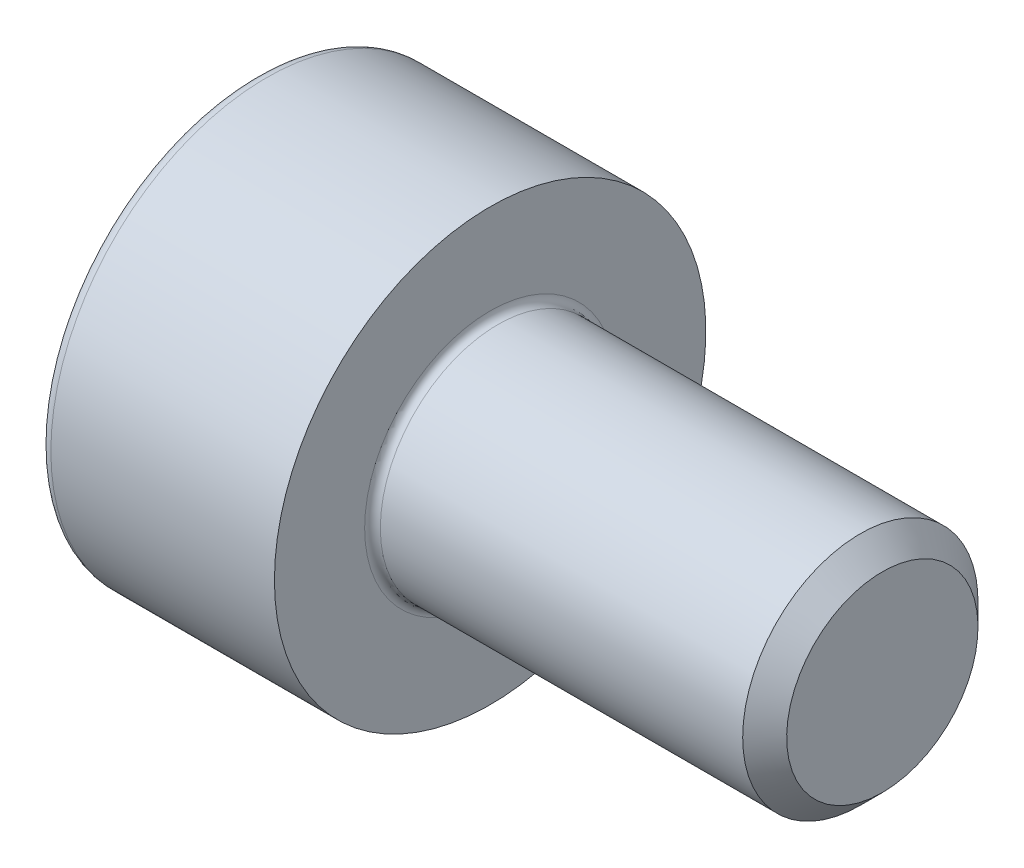
ISO-10303-21;
HEADER;
FILE_DESCRIPTION(('STEP AP214'),'2;1');
FILE_NAME('part.step','',(''),(''),'','','');
FILE_SCHEMA(('AUTOMOTIVE_DESIGN { 1 0 10303 214 1 1 1 1 }'));
ENDSEC;
DATA;
#1=APPLICATION_CONTEXT('core data for automotive mechanical design processes');
#2=APPLICATION_PROTOCOL_DEFINITION('international standard','automotive_design',2000,#1);
#3=PRODUCT_CONTEXT('',#1,'mechanical');
#4=PRODUCT('Part','Part','',(#3));
#5=PRODUCT_RELATED_PRODUCT_CATEGORY('part','',(#4));
#6=PRODUCT_DEFINITION_FORMATION('','',#4);
#7=PRODUCT_DEFINITION_CONTEXT('part definition',#1,'design');
#8=PRODUCT_DEFINITION('design','',#6,#7);
#9=PRODUCT_DEFINITION_SHAPE('','',#8);
#10=(LENGTH_UNIT() NAMED_UNIT(*) SI_UNIT(.MILLI.,.METRE.));
#11=(NAMED_UNIT(*) PLANE_ANGLE_UNIT() SI_UNIT($,.RADIAN.));
#12=(NAMED_UNIT(*) SI_UNIT($,.STERADIAN.) SOLID_ANGLE_UNIT());
#13=UNCERTAINTY_MEASURE_WITH_UNIT(LENGTH_MEASURE(1.E-05),#10,'distance_accuracy_value','');
#14=(GEOMETRIC_REPRESENTATION_CONTEXT(3) GLOBAL_UNCERTAINTY_ASSIGNED_CONTEXT((#13)) GLOBAL_UNIT_ASSIGNED_CONTEXT((#10,
#11,#12)) REPRESENTATION_CONTEXT('',''));
#15=CARTESIAN_POINT('',(0.,0.,0.));
#16=DIRECTION('',(0.,0.,1.));
#17=DIRECTION('',(1.,0.,0.));
#18=AXIS2_PLACEMENT_3D('',#15,#16,#17);
#19=CARTESIAN_POINT('',(8.,1.2195,0.));
#20=DIRECTION('',(1.,0.,0.));
#21=DIRECTION('',(0.,0.,-1.));
#22=AXIS2_PLACEMENT_3D('',#19,#20,#21);
#23=PLANE('',#22);
#24=CARTESIAN_POINT('',(7.99999999992451,0.,0.));
#25=DIRECTION('',(-1.,0.,0.));
#26=DIRECTION('',(0.,-1.,0.));
#27=AXIS2_PLACEMENT_3D('',#24,#25,#26);
#28=CIRCLE('',#27,1.2194999999906);
#29=CARTESIAN_POINT('',(7.99999999992451,-1.2194999999906,0.));
#30=VERTEX_POINT('',#29);
#31=EDGE_CURVE('E107',#30,#30,#28,.T.);
#32=ORIENTED_EDGE('',*,*,#31,.F.);
#33=EDGE_LOOP('',(#32));
#34=FACE_BOUND('',#33,.T.);
#35=ADVANCED_FACE('F16',(#34),#23,.T.);
#36=CARTESIAN_POINT('',(1.30000000012842,0.,0.));
#37=DIRECTION('',(-1.,0.,0.));
#38=DIRECTION('',(0.,0.,1.));
#39=AXIS2_PLACEMENT_3D('',#36,#37,#38);
#40=CONICAL_SURFACE('',#39,1.27999999978101,1.04719755091874);
#41=CARTESIAN_POINT('',(2.0390083446955,0.,2.8421709430404E-10));
#42=VERTEX_POINT('',#41);
#43=VERTEX_LOOP('',#42);
#44=FACE_BOUND('',#43,.T.);
#45=CARTESIAN_POINT('',(1.29999999999715,0.,0.));
#46=DIRECTION('',(-1.,0.,0.));
#47=DIRECTION('',(0.,0.,1.));
#48=AXIS2_PLACEMENT_3D('',#45,#46,#47);
#49=CIRCLE('',#48,1.28000000000839);
#50=CARTESIAN_POINT('',(1.29999999999857,-1.10851251684771,0.640000000002098));
#51=VERTEX_POINT('',#50);
#52=CARTESIAN_POINT('',(1.30000000000226,0.,1.28000000000209));
#53=VERTEX_POINT('',#52);
#54=EDGE_CURVE('E96',#51,#53,#49,.T.);
#55=ORIENTED_EDGE('',*,*,#54,.T.);
#56=CARTESIAN_POINT('',(1.29999999999715,0.,0.));
#57=DIRECTION('',(-1.,0.,0.));
#58=DIRECTION('',(0.,0.,1.));
#59=AXIS2_PLACEMENT_3D('',#56,#57,#58);
#60=CIRCLE('',#59,1.28000000000839);
#61=CARTESIAN_POINT('',(1.29999999999857,1.10851251684771,0.640000000002095));
#62=VERTEX_POINT('',#61);
#63=EDGE_CURVE('E99',#53,#62,#60,.T.);
#64=ORIENTED_EDGE('',*,*,#63,.T.);
#65=CARTESIAN_POINT('',(1.29999999999715,0.,0.));
#66=DIRECTION('',(-1.,0.,0.));
#67=DIRECTION('',(0.,0.,1.));
#68=AXIS2_PLACEMENT_3D('',#65,#66,#67);
#69=CIRCLE('',#68,1.28000000000839);
#70=CARTESIAN_POINT('',(1.29999999999857,1.10851251684771,-0.640000000002099));
#71=VERTEX_POINT('',#70);
#72=EDGE_CURVE('E102',#62,#71,#69,.T.);
#73=ORIENTED_EDGE('',*,*,#72,.T.);
#74=CARTESIAN_POINT('',(1.29999999999715,0.,0.));
#75=DIRECTION('',(-1.,0.,0.));
#76=DIRECTION('',(0.,0.,1.));
#77=AXIS2_PLACEMENT_3D('',#74,#75,#76);
#78=CIRCLE('',#77,1.28000000000839);
#79=CARTESIAN_POINT('',(1.30000000000226,0.,-1.28000000000629));
#80=VERTEX_POINT('',#79);
#81=EDGE_CURVE('E117',#71,#80,#78,.T.);
#82=ORIENTED_EDGE('',*,*,#81,.T.);
#83=CARTESIAN_POINT('',(1.29999999999715,0.,0.));
#84=DIRECTION('',(-1.,0.,0.));
#85=DIRECTION('',(0.,0.,1.));
#86=AXIS2_PLACEMENT_3D('',#83,#84,#85);
#87=CIRCLE('',#86,1.28000000000839);
#88=CARTESIAN_POINT('',(1.29999999999857,-1.10851251684771,-0.640000000002097));
#89=VERTEX_POINT('',#88);
#90=EDGE_CURVE('E118',#80,#89,#87,.T.);
#91=ORIENTED_EDGE('',*,*,#90,.T.);
#92=CARTESIAN_POINT('',(1.29999999999715,0.,0.));
#93=DIRECTION('',(-1.,0.,0.));
#94=DIRECTION('',(0.,0.,1.));
#95=AXIS2_PLACEMENT_3D('',#92,#93,#94);
#96=CIRCLE('',#95,1.28000000000839);
#97=EDGE_CURVE('E225',#89,#51,#96,.T.);
#98=ORIENTED_EDGE('',*,*,#97,.T.);
#99=EDGE_LOOP('',(#55,#64,#73,#82,#91,#98));
#100=FACE_BOUND('',#99,.T.);
#101=ADVANCED_FACE('F101',(#44,#100),#40,.F.);
#102=CARTESIAN_POINT('',(7.71950000000743,0.,0.));
#103=DIRECTION('',(-1.,0.,0.));
#104=DIRECTION('',(0.,-1.,0.));
#105=AXIS2_PLACEMENT_3D('',#102,#103,#104);
#106=CONICAL_SURFACE('',#105,1.49999999996453,0.785398163498773);
#107=CARTESIAN_POINT('',(7.71949999999995,0.,0.));
#108=DIRECTION('',(-1.,0.,0.));
#109=DIRECTION('',(0.,0.,1.));
#110=AXIS2_PLACEMENT_3D('',#107,#108,#109);
#111=CIRCLE('',#110,1.49999999999997);
#112=CARTESIAN_POINT('',(7.71949999999995,0.,1.49999999999997));
#113=VERTEX_POINT('',#112);
#114=EDGE_CURVE('E132',#113,#113,#111,.T.);
#115=ORIENTED_EDGE('',*,*,#114,.F.);
#116=EDGE_LOOP('',(#115));
#117=FACE_BOUND('',#116,.T.);
#118=ORIENTED_EDGE('',*,*,#31,.T.);
#119=EDGE_LOOP('',(#118));
#120=FACE_BOUND('',#119,.T.);
#121=ADVANCED_FACE('F518',(#117,#120),#106,.T.);
#122=CARTESIAN_POINT('',(1.3,1.47801668912544,0.));
#123=DIRECTION('',(1.,0.,0.));
#124=DIRECTION('',(0.,0.,-1.));
#125=AXIS2_PLACEMENT_3D('',#122,#123,#124);
#126=PLANE('',#125);
#127=DIRECTION('',(0.,0.499999999999999,-0.866025403784439));
#128=VECTOR('',#127,1.);
#129=CARTESIAN_POINT('',(1.3,1.47801668912544,0.));
#130=LINE('',#129,#128);
#131=CARTESIAN_POINT('',(1.3,0.73900834456272,1.28));
#132=VERTEX_POINT('',#131);
#133=EDGE_CURVE('E121',#62,#132,#130,.F.);
#134=ORIENTED_EDGE('',*,*,#133,.F.);
#135=ORIENTED_EDGE('',*,*,#63,.F.);
#136=DIRECTION('',(0.,-1.,0.));
#137=VECTOR('',#136,1.);
#138=CARTESIAN_POINT('',(1.3,-0.739008344562723,1.28));
#139=LINE('',#138,#137);
#140=EDGE_CURVE('E123',#53,#132,#139,.F.);
#141=ORIENTED_EDGE('',*,*,#140,.T.);
#142=EDGE_LOOP('',(#134,#135,#141));
#143=FACE_BOUND('',#142,.T.);
#144=ADVANCED_FACE('F122',(#143),#126,.F.);
#145=CARTESIAN_POINT('',(1.3,1.47801668912544,0.));
#146=DIRECTION('',(1.,0.,0.));
#147=DIRECTION('',(0.,0.,-1.));
#148=AXIS2_PLACEMENT_3D('',#145,#146,#147);
#149=PLANE('',#148);
#150=DIRECTION('',(0.,-1.,0.));
#151=VECTOR('',#150,1.);
#152=CARTESIAN_POINT('',(1.3,-0.739008344562723,1.28));
#153=LINE('',#152,#151);
#154=CARTESIAN_POINT('',(1.3,-0.739008344562723,1.28));
#155=VERTEX_POINT('',#154);
#156=EDGE_CURVE('E127',#155,#53,#153,.F.);
#157=ORIENTED_EDGE('',*,*,#156,.T.);
#158=ORIENTED_EDGE('',*,*,#54,.F.);
#159=DIRECTION('',(0.,0.500000000000001,0.866025403784438));
#160=VECTOR('',#159,1.);
#161=CARTESIAN_POINT('',(1.3,-0.739008344562723,1.28));
#162=LINE('',#161,#160);
#163=EDGE_CURVE('E182',#155,#51,#162,.F.);
#164=ORIENTED_EDGE('',*,*,#163,.F.);
#165=EDGE_LOOP('',(#157,#158,#164));
#166=FACE_BOUND('',#165,.T.);
#167=ADVANCED_FACE('F371',(#166),#149,.F.);
#168=CARTESIAN_POINT('',(1.3,1.47801668912544,0.));
#169=DIRECTION('',(1.,0.,0.));
#170=DIRECTION('',(0.,0.,-1.));
#171=AXIS2_PLACEMENT_3D('',#168,#169,#170);
#172=PLANE('',#171);
#173=DIRECTION('',(0.,0.500000000000001,0.866025403784438));
#174=VECTOR('',#173,1.);
#175=CARTESIAN_POINT('',(1.3,-0.739008344562723,1.28));
#176=LINE('',#175,#174);
#177=CARTESIAN_POINT('',(1.3,-1.47801668912545,0.));
#178=VERTEX_POINT('',#177);
#179=EDGE_CURVE('E178',#51,#178,#176,.F.);
#180=ORIENTED_EDGE('',*,*,#179,.F.);
#181=ORIENTED_EDGE('',*,*,#97,.F.);
#182=DIRECTION('',(0.,-0.499999999999999,0.866025403784439));
#183=VECTOR('',#182,1.);
#184=CARTESIAN_POINT('',(1.3,-1.47801668912545,0.));
#185=LINE('',#184,#183);
#186=EDGE_CURVE('E164',#178,#89,#185,.F.);
#187=ORIENTED_EDGE('',*,*,#186,.F.);
#188=EDGE_LOOP('',(#180,#181,#187));
#189=FACE_BOUND('',#188,.T.);
#190=ADVANCED_FACE('F366',(#189),#172,.F.);
#191=CARTESIAN_POINT('',(1.3,1.47801668912544,0.));
#192=DIRECTION('',(1.,0.,0.));
#193=DIRECTION('',(0.,0.,-1.));
#194=AXIS2_PLACEMENT_3D('',#191,#192,#193);
#195=PLANE('',#194);
#196=DIRECTION('',(0.,-0.499999999999999,0.866025403784439));
#197=VECTOR('',#196,1.);
#198=CARTESIAN_POINT('',(1.3,-1.47801668912545,0.));
#199=LINE('',#198,#197);
#200=CARTESIAN_POINT('',(1.3,-0.739008344562726,-1.28));
#201=VERTEX_POINT('',#200);
#202=EDGE_CURVE('E161',#89,#201,#199,.F.);
#203=ORIENTED_EDGE('',*,*,#202,.F.);
#204=ORIENTED_EDGE('',*,*,#90,.F.);
#205=DIRECTION('',(0.,1.,0.));
#206=VECTOR('',#205,1.);
#207=CARTESIAN_POINT('',(1.3,0.739008344562715,-1.28));
#208=LINE('',#207,#206);
#209=EDGE_CURVE('E155',#80,#201,#208,.F.);
#210=ORIENTED_EDGE('',*,*,#209,.T.);
#211=EDGE_LOOP('',(#203,#204,#210));
#212=FACE_BOUND('',#211,.T.);
#213=ADVANCED_FACE('F361',(#212),#195,.F.);
#214=CARTESIAN_POINT('',(1.3,1.47801668912544,0.));
#215=DIRECTION('',(1.,0.,0.));
#216=DIRECTION('',(0.,0.,-1.));
#217=AXIS2_PLACEMENT_3D('',#214,#215,#216);
#218=PLANE('',#217);
#219=DIRECTION('',(0.,0.500000000000002,0.866025403784438));
#220=VECTOR('',#219,1.);
#221=CARTESIAN_POINT('',(1.3,1.47801668912544,0.));
#222=LINE('',#221,#220);
#223=CARTESIAN_POINT('',(1.3,1.47801668912544,0.));
#224=VERTEX_POINT('',#223);
#225=EDGE_CURVE('E115',#224,#71,#222,.F.);
#226=ORIENTED_EDGE('',*,*,#225,.T.);
#227=ORIENTED_EDGE('',*,*,#72,.F.);
#228=DIRECTION('',(0.,0.499999999999999,-0.866025403784439));
#229=VECTOR('',#228,1.);
#230=CARTESIAN_POINT('',(1.3,1.47801668912544,0.));
#231=LINE('',#230,#229);
#232=EDGE_CURVE('E112',#224,#62,#231,.F.);
#233=ORIENTED_EDGE('',*,*,#232,.F.);
#234=EDGE_LOOP('',(#226,#227,#233));
#235=FACE_BOUND('',#234,.T.);
#236=ADVANCED_FACE('F110',(#235),#218,.F.);
#237=CARTESIAN_POINT('',(1.3,1.47801668912544,0.));
#238=DIRECTION('',(1.,0.,0.));
#239=DIRECTION('',(0.,0.,-1.));
#240=AXIS2_PLACEMENT_3D('',#237,#238,#239);
#241=PLANE('',#240);
#242=DIRECTION('',(0.,1.,0.));
#243=VECTOR('',#242,1.);
#244=CARTESIAN_POINT('',(1.3,0.739008344562715,-1.28));
#245=LINE('',#244,#243);
#246=CARTESIAN_POINT('',(1.3,0.739008344562716,-1.28));
#247=VERTEX_POINT('',#246);
#248=EDGE_CURVE('E158',#247,#80,#245,.F.);
#249=ORIENTED_EDGE('',*,*,#248,.T.);
#250=ORIENTED_EDGE('',*,*,#81,.F.);
#251=DIRECTION('',(0.,0.500000000000002,0.866025403784438));
#252=VECTOR('',#251,1.);
#253=CARTESIAN_POINT('',(1.3,1.47801668912544,0.));
#254=LINE('',#253,#252);
#255=EDGE_CURVE('E327',#71,#247,#254,.F.);
#256=ORIENTED_EDGE('',*,*,#255,.T.);
#257=EDGE_LOOP('',(#249,#250,#256));
#258=FACE_BOUND('',#257,.T.);
#259=ADVANCED_FACE('F471',(#258),#241,.F.);
#260=CARTESIAN_POINT('',(-31.75,0.,0.));
#261=DIRECTION('',(-1.,0.,0.));
#262=DIRECTION('',(0.,0.,1.));
#263=AXIS2_PLACEMENT_3D('',#260,#261,#262);
#264=CYLINDRICAL_SURFACE('',#263,1.49999999999997);
#265=CARTESIAN_POINT('',(3.10000000000001,0.,0.));
#266=DIRECTION('',(1.,0.,0.));
#267=DIRECTION('',(0.,0.,-1.));
#268=AXIS2_PLACEMENT_3D('',#265,#266,#267);
#269=CIRCLE('',#268,1.49999999999997);
#270=CARTESIAN_POINT('',(3.10000000000001,0.,-1.49999999999997));
#271=VERTEX_POINT('',#270);
#272=EDGE_CURVE('E146',#271,#271,#269,.T.);
#273=ORIENTED_EDGE('',*,*,#272,.T.);
#274=EDGE_LOOP('',(#273));
#275=FACE_BOUND('',#274,.T.);
#276=ORIENTED_EDGE('',*,*,#114,.T.);
#277=EDGE_LOOP('',(#276));
#278=FACE_BOUND('',#277,.T.);
#279=ADVANCED_FACE('F383',(#275,#278),#264,.T.);
#280=CARTESIAN_POINT('',(1.3,1.47801668912544,0.));
#281=DIRECTION('',(0.,-0.866025403784439,-0.499999999999999));
#282=DIRECTION('',(0.,0.499999999999999,-0.866025403784439));
#283=AXIS2_PLACEMENT_3D('',#280,#281,#282);
#284=PLANE('',#283);
#285=ORIENTED_EDGE('',*,*,#133,.T.);
#286=DIRECTION('',(1.,0.,0.));
#287=VECTOR('',#286,1.);
#288=CARTESIAN_POINT('',(1.3,0.73900834456272,1.28));
#289=LINE('',#288,#287);
#290=CARTESIAN_POINT('',(0.,0.73900834456272,1.28));
#291=VERTEX_POINT('',#290);
#292=EDGE_CURVE('E202',#132,#291,#289,.F.);
#293=ORIENTED_EDGE('',*,*,#292,.T.);
#294=DIRECTION('',(0.,-0.499999999999999,0.866025403784439));
#295=VECTOR('',#294,1.);
#296=CARTESIAN_POINT('',(0.,1.47801668912544,0.));
#297=LINE('',#296,#295);
#298=CARTESIAN_POINT('',(0.,1.47801668912544,0.));
#299=VERTEX_POINT('',#298);
#300=EDGE_CURVE('E142',#299,#291,#297,.T.);
#301=ORIENTED_EDGE('',*,*,#300,.F.);
#302=DIRECTION('',(1.,0.,0.));
#303=VECTOR('',#302,1.);
#304=CARTESIAN_POINT('',(1.3,1.47801668912544,0.));
#305=LINE('',#304,#303);
#306=EDGE_CURVE('E131',#299,#224,#305,.T.);
#307=ORIENTED_EDGE('',*,*,#306,.T.);
#308=ORIENTED_EDGE('',*,*,#232,.T.);
#309=EDGE_LOOP('',(#285,#293,#301,#307,#308));
#310=FACE_BOUND('',#309,.T.);
#311=ADVANCED_FACE('F129',(#310),#284,.T.);
#312=CARTESIAN_POINT('',(1.3,-0.739008344562723,1.28));
#313=DIRECTION('',(0.,0.,1.));
#314=DIRECTION('',(0.,-1.,0.));
#315=AXIS2_PLACEMENT_3D('',#312,#313,#314);
#316=PLANE('',#315);
#317=ORIENTED_EDGE('',*,*,#292,.F.);
#318=ORIENTED_EDGE('',*,*,#140,.F.);
#319=ORIENTED_EDGE('',*,*,#156,.F.);
#320=DIRECTION('',(1.,0.,0.));
#321=VECTOR('',#320,1.);
#322=CARTESIAN_POINT('',(1.3,-0.739008344562723,1.28));
#323=LINE('',#322,#321);
#324=CARTESIAN_POINT('',(0.,-0.739008344562723,1.28));
#325=VERTEX_POINT('',#324);
#326=EDGE_CURVE('E197',#325,#155,#323,.T.);
#327=ORIENTED_EDGE('',*,*,#326,.F.);
#328=DIRECTION('',(0.,1.,0.));
#329=VECTOR('',#328,1.);
#330=CARTESIAN_POINT('',(0.,0.,1.28));
#331=LINE('',#330,#329);
#332=EDGE_CURVE('E145',#291,#325,#331,.F.);
#333=ORIENTED_EDGE('',*,*,#332,.F.);
#334=EDGE_LOOP('',(#317,#318,#319,#327,#333));
#335=FACE_BOUND('',#334,.T.);
#336=ADVANCED_FACE('F373',(#335),#316,.F.);
#337=CARTESIAN_POINT('',(1.3,-0.739008344562723,1.28));
#338=DIRECTION('',(0.,0.866025403784438,-0.500000000000001));
#339=DIRECTION('',(0.,0.500000000000001,0.866025403784438));
#340=AXIS2_PLACEMENT_3D('',#337,#338,#339);
#341=PLANE('',#340);
#342=ORIENTED_EDGE('',*,*,#179,.T.);
#343=DIRECTION('',(1.,0.,0.));
#344=VECTOR('',#343,1.);
#345=CARTESIAN_POINT('',(1.3,-1.47801668912545,0.));
#346=LINE('',#345,#344);
#347=CARTESIAN_POINT('',(0.,-1.47801668912545,0.));
#348=VERTEX_POINT('',#347);
#349=EDGE_CURVE('E173',#348,#178,#346,.T.);
#350=ORIENTED_EDGE('',*,*,#349,.F.);
#351=DIRECTION('',(0.,-0.500000000000001,-0.866025403784438));
#352=VECTOR('',#351,1.);
#353=CARTESIAN_POINT('',(0.,-0.739008344562723,1.28));
#354=LINE('',#353,#352);
#355=EDGE_CURVE('E188',#325,#348,#354,.T.);
#356=ORIENTED_EDGE('',*,*,#355,.F.);
#357=ORIENTED_EDGE('',*,*,#326,.T.);
#358=ORIENTED_EDGE('',*,*,#163,.T.);
#359=EDGE_LOOP('',(#342,#350,#356,#357,#358));
#360=FACE_BOUND('',#359,.T.);
#361=ADVANCED_FACE('F369',(#360),#341,.T.);
#362=CARTESIAN_POINT('',(1.3,-1.47801668912545,0.));
#363=DIRECTION('',(0.,0.866025403784439,0.499999999999999));
#364=DIRECTION('',(0.,-0.499999999999999,0.866025403784439));
#365=AXIS2_PLACEMENT_3D('',#362,#363,#364);
#366=PLANE('',#365);
#367=ORIENTED_EDGE('',*,*,#202,.T.);
#368=DIRECTION('',(1.,0.,0.));
#369=VECTOR('',#368,1.);
#370=CARTESIAN_POINT('',(1.3,-0.739008344562726,-1.28));
#371=LINE('',#370,#369);
#372=CARTESIAN_POINT('',(0.,-0.739008344562726,-1.28));
#373=VERTEX_POINT('',#372);
#374=EDGE_CURVE('E157',#201,#373,#371,.F.);
#375=ORIENTED_EDGE('',*,*,#374,.T.);
#376=DIRECTION('',(0.,0.499999999999999,-0.866025403784439));
#377=VECTOR('',#376,1.);
#378=CARTESIAN_POINT('',(0.,-1.47801668912545,0.));
#379=LINE('',#378,#377);
#380=EDGE_CURVE('E185',#348,#373,#379,.T.);
#381=ORIENTED_EDGE('',*,*,#380,.F.);
#382=ORIENTED_EDGE('',*,*,#349,.T.);
#383=ORIENTED_EDGE('',*,*,#186,.T.);
#384=EDGE_LOOP('',(#367,#375,#381,#382,#383));
#385=FACE_BOUND('',#384,.T.);
#386=ADVANCED_FACE('F357',(#385),#366,.T.);
#387=CARTESIAN_POINT('',(1.3,0.739008344562715,-1.28));
#388=DIRECTION('',(0.,0.,-1.));
#389=DIRECTION('',(0.,1.,0.));
#390=AXIS2_PLACEMENT_3D('',#387,#388,#389);
#391=PLANE('',#390);
#392=ORIENTED_EDGE('',*,*,#374,.F.);
#393=ORIENTED_EDGE('',*,*,#209,.F.);
#394=ORIENTED_EDGE('',*,*,#248,.F.);
#395=DIRECTION('',(1.,0.,0.));
#396=VECTOR('',#395,1.);
#397=CARTESIAN_POINT('',(1.3,0.739008344562715,-1.28));
#398=LINE('',#397,#396);
#399=CARTESIAN_POINT('',(0.,0.739008344562716,-1.28));
#400=VERTEX_POINT('',#399);
#401=EDGE_CURVE('E325',#247,#400,#398,.F.);
#402=ORIENTED_EDGE('',*,*,#401,.T.);
#403=DIRECTION('',(0.,1.,0.));
#404=VECTOR('',#403,1.);
#405=CARTESIAN_POINT('',(0.,0.,-1.28));
#406=LINE('',#405,#404);
#407=EDGE_CURVE('E152',#373,#400,#406,.T.);
#408=ORIENTED_EDGE('',*,*,#407,.F.);
#409=EDGE_LOOP('',(#392,#393,#394,#402,#408));
#410=FACE_BOUND('',#409,.T.);
#411=ADVANCED_FACE('F346',(#410),#391,.F.);
#412=CARTESIAN_POINT('',(1.3,1.47801668912544,0.));
#413=DIRECTION('',(0.,0.866025403784438,-0.500000000000002));
#414=DIRECTION('',(0.,0.500000000000002,0.866025403784438));
#415=AXIS2_PLACEMENT_3D('',#412,#413,#414);
#416=PLANE('',#415);
#417=ORIENTED_EDGE('',*,*,#401,.F.);
#418=ORIENTED_EDGE('',*,*,#255,.F.);
#419=ORIENTED_EDGE('',*,*,#225,.F.);
#420=ORIENTED_EDGE('',*,*,#306,.F.);
#421=DIRECTION('',(0.,0.500000000000002,0.866025403784437));
#422=VECTOR('',#421,1.);
#423=CARTESIAN_POINT('',(0.,0.739008344562715,-1.28));
#424=LINE('',#423,#422);
#425=EDGE_CURVE('E149',#400,#299,#424,.T.);
#426=ORIENTED_EDGE('',*,*,#425,.F.);
#427=EDGE_LOOP('',(#417,#418,#419,#420,#426));
#428=FACE_BOUND('',#427,.T.);
#429=ADVANCED_FACE('F351',(#428),#416,.F.);
#430=CARTESIAN_POINT('',(3.10000000000001,0.,0.));
#431=DIRECTION('',(1.,0.,0.));
#432=DIRECTION('',(0.,0.,-1.));
#433=AXIS2_PLACEMENT_3D('',#430,#431,#432);
#434=TOROIDAL_SURFACE('',#433,1.59999999999997,0.1);
#435=ORIENTED_EDGE('',*,*,#272,.F.);
#436=EDGE_LOOP('',(#435));
#437=FACE_BOUND('',#436,.T.);
#438=CARTESIAN_POINT('',(3.00000000000001,0.,0.));
#439=DIRECTION('',(1.,0.,0.));
#440=DIRECTION('',(0.,0.,1.));
#441=AXIS2_PLACEMENT_3D('',#438,#439,#440);
#442=CIRCLE('',#441,1.59999999999997);
#443=CARTESIAN_POINT('',(3.,0.,-1.59999999999997));
#444=VERTEX_POINT('',#443);
#445=CARTESIAN_POINT('',(3.,0.,1.59999999999997));
#446=VERTEX_POINT('',#445);
#447=EDGE_CURVE('E258',#444,#446,#442,.F.);
#448=ORIENTED_EDGE('',*,*,#447,.F.);
#449=CARTESIAN_POINT('',(3.00000000000001,0.,0.));
#450=DIRECTION('',(1.,0.,0.));
#451=DIRECTION('',(0.,0.,-1.));
#452=AXIS2_PLACEMENT_3D('',#449,#450,#451);
#453=CIRCLE('',#452,1.59999999999997);
#454=EDGE_CURVE('E268',#446,#444,#453,.F.);
#455=ORIENTED_EDGE('',*,*,#454,.F.);
#456=EDGE_LOOP('',(#448,#455));
#457=FACE_BOUND('',#456,.T.);
#458=ADVANCED_FACE('F289',(#437,#457),#434,.F.);
#459=CARTESIAN_POINT('',(0.,0.,0.));
#460=DIRECTION('',(-1.,0.,0.));
#461=DIRECTION('',(0.,0.,1.));
#462=AXIS2_PLACEMENT_3D('',#459,#460,#461);
#463=PLANE('',#462);
#464=CARTESIAN_POINT('',(0.,0.,0.));
#465=DIRECTION('',(1.,0.,0.));
#466=DIRECTION('',(0.,0.,-1.));
#467=AXIS2_PLACEMENT_3D('',#464,#465,#466);
#468=CIRCLE('',#467,2.6);
#469=CARTESIAN_POINT('',(0.,0.,-2.6));
#470=VERTEX_POINT('',#469);
#471=CARTESIAN_POINT('',(0.,0.,2.6));
#472=VERTEX_POINT('',#471);
#473=EDGE_CURVE('E222',#470,#472,#468,.T.);
#474=ORIENTED_EDGE('',*,*,#473,.F.);
#475=CARTESIAN_POINT('',(0.,0.,0.));
#476=DIRECTION('',(1.,0.,0.));
#477=DIRECTION('',(0.,0.,1.));
#478=AXIS2_PLACEMENT_3D('',#475,#476,#477);
#479=CIRCLE('',#478,2.6);
#480=EDGE_CURVE('E35',#472,#470,#479,.T.);
#481=ORIENTED_EDGE('',*,*,#480,.F.);
#482=EDGE_LOOP('',(#474,#481));
#483=FACE_BOUND('',#482,.T.);
#484=ORIENTED_EDGE('',*,*,#407,.T.);
#485=ORIENTED_EDGE('',*,*,#425,.T.);
#486=ORIENTED_EDGE('',*,*,#300,.T.);
#487=ORIENTED_EDGE('',*,*,#332,.T.);
#488=ORIENTED_EDGE('',*,*,#355,.T.);
#489=ORIENTED_EDGE('',*,*,#380,.T.);
#490=EDGE_LOOP('',(#484,#485,#486,#487,#488,#489));
#491=FACE_BOUND('',#490,.T.);
#492=ADVANCED_FACE('F281',(#483,#491),#463,.T.);
#493=CARTESIAN_POINT('',(3.,2.75,0.));
#494=DIRECTION('',(1.,0.,0.));
#495=DIRECTION('',(0.,0.,-1.));
#496=AXIS2_PLACEMENT_3D('',#493,#494,#495);
#497=PLANE('',#496);
#498=CARTESIAN_POINT('',(3.,0.,0.));
#499=DIRECTION('',(-1.,0.,0.));
#500=DIRECTION('',(0.,0.,1.));
#501=AXIS2_PLACEMENT_3D('',#498,#499,#500);
#502=CIRCLE('',#501,2.75);
#503=CARTESIAN_POINT('',(3.,0.,2.75));
#504=VERTEX_POINT('',#503);
#505=EDGE_CURVE('E27',#504,#504,#502,.T.);
#506=ORIENTED_EDGE('',*,*,#505,.F.);
#507=EDGE_LOOP('',(#506));
#508=FACE_BOUND('',#507,.T.);
#509=ORIENTED_EDGE('',*,*,#447,.T.);
#510=ORIENTED_EDGE('',*,*,#454,.T.);
#511=EDGE_LOOP('',(#509,#510));
#512=FACE_BOUND('',#511,.T.);
#513=ADVANCED_FACE('F247',(#508,#512),#497,.T.);
#514=CARTESIAN_POINT('',(0.149999999999997,0.,0.));
#515=DIRECTION('',(-1.,0.,0.));
#516=DIRECTION('',(0.,0.,1.));
#517=AXIS2_PLACEMENT_3D('',#514,#515,#516);
#518=TOROIDAL_SURFACE('',#517,2.6,0.15);
#519=ORIENTED_EDGE('',*,*,#480,.T.);
#520=ORIENTED_EDGE('',*,*,#473,.T.);
#521=EDGE_LOOP('',(#519,#520));
#522=FACE_BOUND('',#521,.T.);
#523=CARTESIAN_POINT('',(0.149999999999997,0.,0.));
#524=DIRECTION('',(-1.,0.,0.));
#525=DIRECTION('',(0.,0.,1.));
#526=AXIS2_PLACEMENT_3D('',#523,#524,#525);
#527=CIRCLE('',#526,2.75);
#528=CARTESIAN_POINT('',(0.149999999999997,0.,2.75));
#529=VERTEX_POINT('',#528);
#530=EDGE_CURVE('E11',#529,#529,#527,.F.);
#531=ORIENTED_EDGE('',*,*,#530,.F.);
#532=EDGE_LOOP('',(#531));
#533=FACE_BOUND('',#532,.T.);
#534=ADVANCED_FACE('F235',(#522,#533),#518,.T.);
#535=CARTESIAN_POINT('',(-31.75,0.,0.));
#536=DIRECTION('',(-1.,0.,0.));
#537=DIRECTION('',(0.,0.,1.));
#538=AXIS2_PLACEMENT_3D('',#535,#536,#537);
#539=CYLINDRICAL_SURFACE('',#538,2.75);
#540=ORIENTED_EDGE('',*,*,#530,.T.);
#541=EDGE_LOOP('',(#540));
#542=FACE_BOUND('',#541,.T.);
#543=ORIENTED_EDGE('',*,*,#505,.T.);
#544=EDGE_LOOP('',(#543));
#545=FACE_BOUND('',#544,.T.);
#546=ADVANCED_FACE('F246',(#542,#545),#539,.T.);
#547=CLOSED_SHELL('',(#35,#101,#121,#144,#167,#190,#213,#236,#259,#279,#311,#336,#361,#386,#411,
#429,#458,#492,#513,#534,#546));
#548=MANIFOLD_SOLID_BREP('B1',#547);
#549=ADVANCED_BREP_SHAPE_REPRESENTATION('',(#18,#548),#14);
#550=SHAPE_DEFINITION_REPRESENTATION(#9,#549);
ENDSEC;
END-ISO-10303-21;
